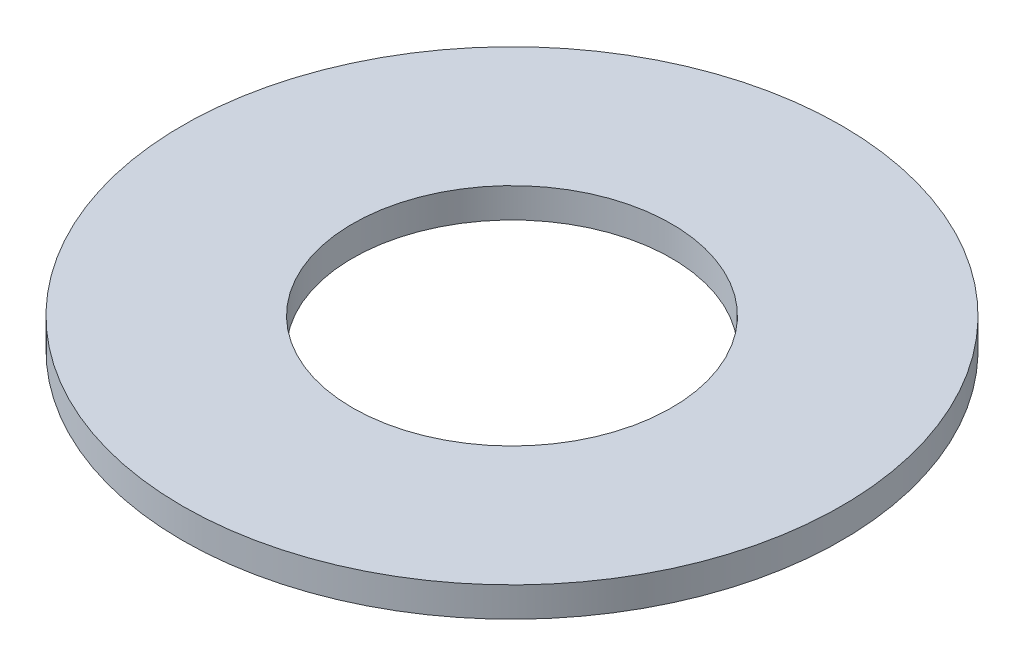
ISO-10303-21;
HEADER;
FILE_DESCRIPTION(('STEP AP214'),'2;1');
FILE_NAME('part.step','',(''),(''),'','','');
FILE_SCHEMA(('AUTOMOTIVE_DESIGN { 1 0 10303 214 1 1 1 1 }'));
ENDSEC;
DATA;
#1=APPLICATION_CONTEXT('core data for automotive mechanical design processes');
#2=APPLICATION_PROTOCOL_DEFINITION('international standard','automotive_design',2000,#1);
#3=PRODUCT_CONTEXT('',#1,'mechanical');
#4=PRODUCT('Part','Part','',(#3));
#5=PRODUCT_RELATED_PRODUCT_CATEGORY('part','',(#4));
#6=PRODUCT_DEFINITION_FORMATION('','',#4);
#7=PRODUCT_DEFINITION_CONTEXT('part definition',#1,'design');
#8=PRODUCT_DEFINITION('design','',#6,#7);
#9=PRODUCT_DEFINITION_SHAPE('','',#8);
#10=(LENGTH_UNIT() NAMED_UNIT(*) SI_UNIT(.MILLI.,.METRE.));
#11=(NAMED_UNIT(*) PLANE_ANGLE_UNIT() SI_UNIT($,.RADIAN.));
#12=(NAMED_UNIT(*) SI_UNIT($,.STERADIAN.) SOLID_ANGLE_UNIT());
#13=UNCERTAINTY_MEASURE_WITH_UNIT(LENGTH_MEASURE(1.E-05),#10,'distance_accuracy_value','');
#14=(GEOMETRIC_REPRESENTATION_CONTEXT(3) GLOBAL_UNCERTAINTY_ASSIGNED_CONTEXT((#13)) GLOBAL_UNIT_ASSIGNED_CONTEXT((#10,
#11,#12)) REPRESENTATION_CONTEXT('',''));
#15=CARTESIAN_POINT('',(0.,0.,0.));
#16=DIRECTION('',(0.,0.,1.));
#17=DIRECTION('',(1.,0.,0.));
#18=AXIS2_PLACEMENT_3D('',#15,#16,#17);
#19=CARTESIAN_POINT('',(0.,7.,0.));
#20=DIRECTION('',(0.,-1.,0.));
#21=DIRECTION('',(0.,0.,-1.));
#22=AXIS2_PLACEMENT_3D('',#19,#20,#21);
#23=CYLINDRICAL_SURFACE('',#22,77.5);
#24=CARTESIAN_POINT('',(0.,7.,0.));
#25=DIRECTION('',(0.,1.,0.));
#26=DIRECTION('',(0.,0.,1.));
#27=AXIS2_PLACEMENT_3D('',#24,#25,#26);
#28=CIRCLE('',#27,77.5);
#29=CARTESIAN_POINT('',(0.,7.,77.5));
#30=VERTEX_POINT('',#29);
#31=EDGE_CURVE('E10',#30,#30,#28,.T.);
#32=ORIENTED_EDGE('',*,*,#31,.F.);
#33=EDGE_LOOP('',(#32));
#34=FACE_BOUND('',#33,.T.);
#35=CARTESIAN_POINT('',(0.,0.,0.));
#36=DIRECTION('',(0.,1.,0.));
#37=DIRECTION('',(0.,0.,1.));
#38=AXIS2_PLACEMENT_3D('',#35,#36,#37);
#39=CIRCLE('',#38,77.5);
#40=CARTESIAN_POINT('',(0.,0.,77.5));
#41=VERTEX_POINT('',#40);
#42=EDGE_CURVE('E37',#41,#41,#39,.T.);
#43=ORIENTED_EDGE('',*,*,#42,.T.);
#44=EDGE_LOOP('',(#43));
#45=FACE_BOUND('',#44,.T.);
#46=ADVANCED_FACE('F40',(#34,#45),#23,.T.);
#47=CARTESIAN_POINT('',(0.,7.,0.));
#48=DIRECTION('',(0.,1.,0.));
#49=DIRECTION('',(0.,0.,1.));
#50=AXIS2_PLACEMENT_3D('',#47,#48,#49);
#51=PLANE('',#50);
#52=CARTESIAN_POINT('',(0.,7.,0.));
#53=DIRECTION('',(0.,1.,0.));
#54=DIRECTION('',(0.,0.,1.));
#55=AXIS2_PLACEMENT_3D('',#52,#53,#54);
#56=CIRCLE('',#55,37.5);
#57=CARTESIAN_POINT('',(0.,7.,37.5));
#58=VERTEX_POINT('',#57);
#59=EDGE_CURVE('E50',#58,#58,#56,.T.);
#60=ORIENTED_EDGE('',*,*,#59,.F.);
#61=EDGE_LOOP('',(#60));
#62=FACE_BOUND('',#61,.T.);
#63=ORIENTED_EDGE('',*,*,#31,.T.);
#64=EDGE_LOOP('',(#63));
#65=FACE_BOUND('',#64,.T.);
#66=ADVANCED_FACE('F59',(#62,#65),#51,.T.);
#67=CARTESIAN_POINT('',(0.,0.,0.));
#68=DIRECTION('',(0.,1.,0.));
#69=DIRECTION('',(0.,0.,1.));
#70=AXIS2_PLACEMENT_3D('',#67,#68,#69);
#71=PLANE('',#70);
#72=CARTESIAN_POINT('',(0.,0.,0.));
#73=DIRECTION('',(0.,1.,0.));
#74=DIRECTION('',(0.,0.,1.));
#75=AXIS2_PLACEMENT_3D('',#72,#73,#74);
#76=CIRCLE('',#75,37.5);
#77=CARTESIAN_POINT('',(0.,0.,37.5));
#78=VERTEX_POINT('',#77);
#79=EDGE_CURVE('E47',#78,#78,#76,.T.);
#80=ORIENTED_EDGE('',*,*,#79,.T.);
#81=EDGE_LOOP('',(#80));
#82=FACE_BOUND('',#81,.T.);
#83=ORIENTED_EDGE('',*,*,#42,.F.);
#84=EDGE_LOOP('',(#83));
#85=FACE_BOUND('',#84,.T.);
#86=ADVANCED_FACE('F58',(#82,#85),#71,.F.);
#87=CARTESIAN_POINT('',(0.,7.,0.));
#88=DIRECTION('',(0.,-1.,0.));
#89=DIRECTION('',(0.,0.,-1.));
#90=AXIS2_PLACEMENT_3D('',#87,#88,#89);
#91=CYLINDRICAL_SURFACE('',#90,37.5);
#92=ORIENTED_EDGE('',*,*,#59,.T.);
#93=EDGE_LOOP('',(#92));
#94=FACE_BOUND('',#93,.T.);
#95=ORIENTED_EDGE('',*,*,#79,.F.);
#96=EDGE_LOOP('',(#95));
#97=FACE_BOUND('',#96,.T.);
#98=ADVANCED_FACE('F54',(#94,#97),#91,.F.);
#99=CLOSED_SHELL('',(#46,#66,#86,#98));
#100=MANIFOLD_SOLID_BREP('B2',#99);
#101=ADVANCED_BREP_SHAPE_REPRESENTATION('',(#18,#100),#14);
#102=SHAPE_DEFINITION_REPRESENTATION(#9,#101);
ENDSEC;
END-ISO-10303-21;
